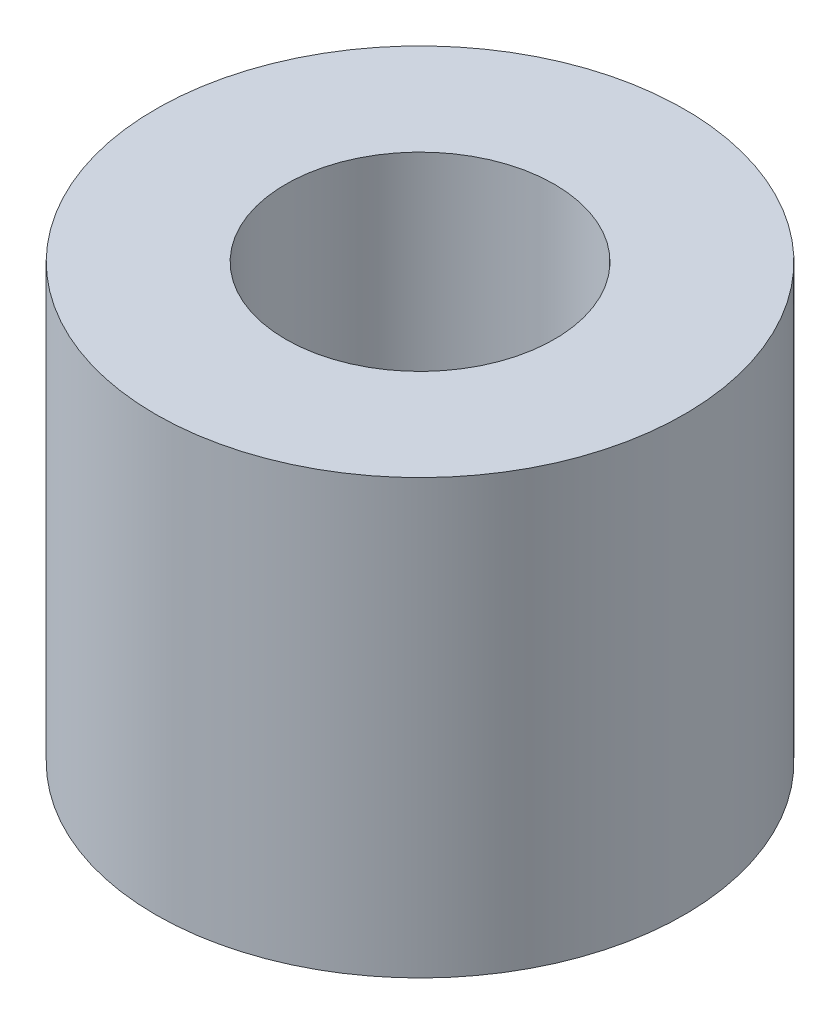
ISO-10303-21;
HEADER;
FILE_DESCRIPTION(('STEP AP214'),'2;1');
FILE_NAME('part.step','',(''),(''),'','','');
FILE_SCHEMA(('AUTOMOTIVE_DESIGN { 1 0 10303 214 1 1 1 1 }'));
ENDSEC;
DATA;
#1=APPLICATION_CONTEXT('core data for automotive mechanical design processes');
#2=APPLICATION_PROTOCOL_DEFINITION('international standard','automotive_design',2000,#1);
#3=PRODUCT_CONTEXT('',#1,'mechanical');
#4=PRODUCT('Part','Part','',(#3));
#5=PRODUCT_RELATED_PRODUCT_CATEGORY('part','',(#4));
#6=PRODUCT_DEFINITION_FORMATION('','',#4);
#7=PRODUCT_DEFINITION_CONTEXT('part definition',#1,'design');
#8=PRODUCT_DEFINITION('design','',#6,#7);
#9=PRODUCT_DEFINITION_SHAPE('','',#8);
#10=(LENGTH_UNIT() NAMED_UNIT(*) SI_UNIT(.MILLI.,.METRE.));
#11=(NAMED_UNIT(*) PLANE_ANGLE_UNIT() SI_UNIT($,.RADIAN.));
#12=(NAMED_UNIT(*) SI_UNIT($,.STERADIAN.) SOLID_ANGLE_UNIT());
#13=UNCERTAINTY_MEASURE_WITH_UNIT(LENGTH_MEASURE(1.E-05),#10,'distance_accuracy_value','');
#14=(GEOMETRIC_REPRESENTATION_CONTEXT(3) GLOBAL_UNCERTAINTY_ASSIGNED_CONTEXT((#13)) GLOBAL_UNIT_ASSIGNED_CONTEXT((#10,
#11,#12)) REPRESENTATION_CONTEXT('',''));
#15=CARTESIAN_POINT('',(0.,0.,0.));
#16=DIRECTION('',(0.,0.,1.));
#17=DIRECTION('',(1.,0.,0.));
#18=AXIS2_PLACEMENT_3D('',#15,#16,#17);
#19=CARTESIAN_POINT('',(0.,5.,0.));
#20=DIRECTION('',(0.,1.,0.));
#21=DIRECTION('',(0.,0.,1.));
#22=AXIS2_PLACEMENT_3D('',#19,#20,#21);
#23=PLANE('',#22);
#24=CARTESIAN_POINT('',(0.,5.,0.));
#25=DIRECTION('',(0.,1.,0.));
#26=DIRECTION('',(0.,0.,1.));
#27=AXIS2_PLACEMENT_3D('',#24,#25,#26);
#28=CIRCLE('',#27,3.05);
#29=CARTESIAN_POINT('',(0.,5.,3.05));
#30=VERTEX_POINT('',#29);
#31=EDGE_CURVE('E10',#30,#30,#28,.T.);
#32=ORIENTED_EDGE('',*,*,#31,.T.);
#33=EDGE_LOOP('',(#32));
#34=FACE_BOUND('',#33,.T.);
#35=CARTESIAN_POINT('',(0.,5.,0.));
#36=DIRECTION('',(0.,1.,0.));
#37=DIRECTION('',(0.,0.,1.));
#38=AXIS2_PLACEMENT_3D('',#35,#36,#37);
#39=CIRCLE('',#38,1.55);
#40=CARTESIAN_POINT('',(0.,5.,1.55));
#41=VERTEX_POINT('',#40);
#42=EDGE_CURVE('E50',#41,#41,#39,.T.);
#43=ORIENTED_EDGE('',*,*,#42,.F.);
#44=EDGE_LOOP('',(#43));
#45=FACE_BOUND('',#44,.T.);
#46=ADVANCED_FACE('F37',(#34,#45),#23,.T.);
#47=CARTESIAN_POINT('',(0.,0.,0.));
#48=DIRECTION('',(0.,1.,0.));
#49=DIRECTION('',(0.,0.,1.));
#50=AXIS2_PLACEMENT_3D('',#47,#48,#49);
#51=PLANE('',#50);
#52=CARTESIAN_POINT('',(0.,0.,0.));
#53=DIRECTION('',(0.,1.,0.));
#54=DIRECTION('',(0.,0.,1.));
#55=AXIS2_PLACEMENT_3D('',#52,#53,#54);
#56=CIRCLE('',#55,3.05);
#57=CARTESIAN_POINT('',(0.,0.,3.05));
#58=VERTEX_POINT('',#57);
#59=EDGE_CURVE('E41',#58,#58,#56,.T.);
#60=ORIENTED_EDGE('',*,*,#59,.F.);
#61=EDGE_LOOP('',(#60));
#62=FACE_BOUND('',#61,.T.);
#63=CARTESIAN_POINT('',(0.,0.,0.));
#64=DIRECTION('',(0.,1.,0.));
#65=DIRECTION('',(0.,0.,1.));
#66=AXIS2_PLACEMENT_3D('',#63,#64,#65);
#67=CIRCLE('',#66,1.55);
#68=CARTESIAN_POINT('',(0.,0.,1.55));
#69=VERTEX_POINT('',#68);
#70=EDGE_CURVE('E52',#69,#69,#67,.T.);
#71=ORIENTED_EDGE('',*,*,#70,.T.);
#72=EDGE_LOOP('',(#71));
#73=FACE_BOUND('',#72,.T.);
#74=ADVANCED_FACE('F64',(#62,#73),#51,.F.);
#75=CARTESIAN_POINT('',(0.,5.,0.));
#76=DIRECTION('',(0.,-1.,0.));
#77=DIRECTION('',(0.,0.,-1.));
#78=AXIS2_PLACEMENT_3D('',#75,#76,#77);
#79=CYLINDRICAL_SURFACE('',#78,3.05);
#80=ORIENTED_EDGE('',*,*,#31,.F.);
#81=EDGE_LOOP('',(#80));
#82=FACE_BOUND('',#81,.T.);
#83=ORIENTED_EDGE('',*,*,#59,.T.);
#84=EDGE_LOOP('',(#83));
#85=FACE_BOUND('',#84,.T.);
#86=ADVANCED_FACE('F39',(#82,#85),#79,.T.);
#87=CARTESIAN_POINT('',(0.,5.,0.));
#88=DIRECTION('',(0.,-1.,0.));
#89=DIRECTION('',(0.,0.,-1.));
#90=AXIS2_PLACEMENT_3D('',#87,#88,#89);
#91=CYLINDRICAL_SURFACE('',#90,1.55);
#92=ORIENTED_EDGE('',*,*,#42,.T.);
#93=EDGE_LOOP('',(#92));
#94=FACE_BOUND('',#93,.T.);
#95=ORIENTED_EDGE('',*,*,#70,.F.);
#96=EDGE_LOOP('',(#95));
#97=FACE_BOUND('',#96,.T.);
#98=ADVANCED_FACE('F60',(#94,#97),#91,.F.);
#99=CLOSED_SHELL('',(#46,#74,#86,#98));
#100=MANIFOLD_SOLID_BREP('B2',#99);
#101=ADVANCED_BREP_SHAPE_REPRESENTATION('',(#18,#100),#14);
#102=SHAPE_DEFINITION_REPRESENTATION(#9,#101);
ENDSEC;
END-ISO-10303-21;
